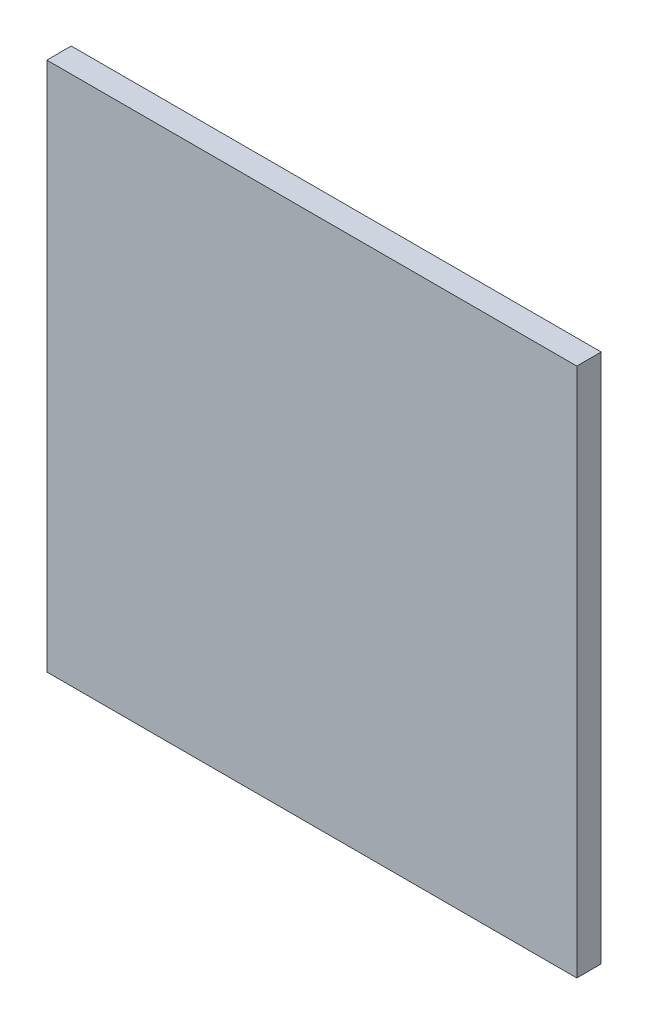
ISO-10303-21;
HEADER;
FILE_DESCRIPTION(('STEP AP214'),'2;1');
FILE_NAME('part.step','',(''),(''),'','','');
FILE_SCHEMA(('AUTOMOTIVE_DESIGN { 1 0 10303 214 1 1 1 1 }'));
ENDSEC;
DATA;
#1=APPLICATION_CONTEXT('core data for automotive mechanical design processes');
#2=APPLICATION_PROTOCOL_DEFINITION('international standard','automotive_design',2000,#1);
#3=PRODUCT_CONTEXT('',#1,'mechanical');
#4=PRODUCT('Part','Part','',(#3));
#5=PRODUCT_RELATED_PRODUCT_CATEGORY('part','',(#4));
#6=PRODUCT_DEFINITION_FORMATION('','',#4);
#7=PRODUCT_DEFINITION_CONTEXT('part definition',#1,'design');
#8=PRODUCT_DEFINITION('design','',#6,#7);
#9=PRODUCT_DEFINITION_SHAPE('','',#8);
#10=(LENGTH_UNIT() NAMED_UNIT(*) SI_UNIT(.MILLI.,.METRE.));
#11=(NAMED_UNIT(*) PLANE_ANGLE_UNIT() SI_UNIT($,.RADIAN.));
#12=(NAMED_UNIT(*) SI_UNIT($,.STERADIAN.) SOLID_ANGLE_UNIT());
#13=UNCERTAINTY_MEASURE_WITH_UNIT(LENGTH_MEASURE(1.E-05),#10,'distance_accuracy_value','');
#14=(GEOMETRIC_REPRESENTATION_CONTEXT(3) GLOBAL_UNCERTAINTY_ASSIGNED_CONTEXT((#13)) GLOBAL_UNIT_ASSIGNED_CONTEXT((#10,
#11,#12)) REPRESENTATION_CONTEXT('',''));
#15=CARTESIAN_POINT('',(0.,0.,0.));
#16=DIRECTION('',(0.,0.,1.));
#17=DIRECTION('',(1.,0.,0.));
#18=AXIS2_PLACEMENT_3D('',#15,#16,#17);
#19=CARTESIAN_POINT('',(177.49587155177,148.126483669053,2.3));
#20=DIRECTION('',(1.,0.,0.));
#21=DIRECTION('',(0.,1.,0.));
#22=AXIS2_PLACEMENT_3D('',#19,#20,#21);
#23=PLANE('',#22);
#24=DIRECTION('',(0.,-1.,0.));
#25=VECTOR('',#24,1.);
#26=CARTESIAN_POINT('',(177.49587155177,148.126483669053,0.));
#27=LINE('',#26,#25);
#28=CARTESIAN_POINT('',(177.49587155177,148.126483669053,0.));
#29=VERTEX_POINT('',#28);
#30=CARTESIAN_POINT('',(177.49587155177,98.1264836690532,0.));
#31=VERTEX_POINT('',#30);
#32=EDGE_CURVE('E100',#29,#31,#27,.T.);
#33=ORIENTED_EDGE('',*,*,#32,.T.);
#34=DIRECTION('',(0.,0.,-1.));
#35=VECTOR('',#34,1.);
#36=CARTESIAN_POINT('',(177.49587155177,98.1264836690532,2.3));
#37=LINE('',#36,#35);
#38=CARTESIAN_POINT('',(177.49587155177,98.1264836690532,2.3));
#39=VERTEX_POINT('',#38);
#40=EDGE_CURVE('E11',#39,#31,#37,.T.);
#41=ORIENTED_EDGE('',*,*,#40,.F.);
#42=DIRECTION('',(0.,-1.,0.));
#43=VECTOR('',#42,1.);
#44=CARTESIAN_POINT('',(177.49587155177,148.126483669053,2.3));
#45=LINE('',#44,#43);
#46=CARTESIAN_POINT('',(177.49587155177,148.126483669053,2.3));
#47=VERTEX_POINT('',#46);
#48=EDGE_CURVE('E88',#47,#39,#45,.T.);
#49=ORIENTED_EDGE('',*,*,#48,.F.);
#50=DIRECTION('',(0.,0.,-1.));
#51=VECTOR('',#50,1.);
#52=CARTESIAN_POINT('',(177.49587155177,148.126483669053,2.3));
#53=LINE('',#52,#51);
#54=EDGE_CURVE('E96',#47,#29,#53,.T.);
#55=ORIENTED_EDGE('',*,*,#54,.T.);
#56=EDGE_LOOP('',(#33,#41,#49,#55));
#57=FACE_BOUND('',#56,.T.);
#58=ADVANCED_FACE('F37',(#57),#23,.F.);
#59=CARTESIAN_POINT('',(177.49587155177,98.1264836690532,2.3));
#60=DIRECTION('',(0.,1.,0.));
#61=DIRECTION('',(0.,0.,1.));
#62=AXIS2_PLACEMENT_3D('',#59,#60,#61);
#63=PLANE('',#62);
#64=DIRECTION('',(1.,0.,0.));
#65=VECTOR('',#64,1.);
#66=CARTESIAN_POINT('',(177.49587155177,98.1264836690532,0.));
#67=LINE('',#66,#65);
#68=CARTESIAN_POINT('',(227.49587155177,98.1264836690532,0.));
#69=VERTEX_POINT('',#68);
#70=EDGE_CURVE('E92',#31,#69,#67,.T.);
#71=ORIENTED_EDGE('',*,*,#70,.T.);
#72=DIRECTION('',(0.,0.,-1.));
#73=VECTOR('',#72,1.);
#74=CARTESIAN_POINT('',(227.49587155177,98.1264836690532,2.3));
#75=LINE('',#74,#73);
#76=CARTESIAN_POINT('',(227.49587155177,98.1264836690532,2.3));
#77=VERTEX_POINT('',#76);
#78=EDGE_CURVE('E45',#77,#69,#75,.T.);
#79=ORIENTED_EDGE('',*,*,#78,.F.);
#80=DIRECTION('',(1.,0.,0.));
#81=VECTOR('',#80,1.);
#82=CARTESIAN_POINT('',(177.49587155177,98.1264836690532,2.3));
#83=LINE('',#82,#81);
#84=EDGE_CURVE('E83',#39,#77,#83,.T.);
#85=ORIENTED_EDGE('',*,*,#84,.F.);
#86=ORIENTED_EDGE('',*,*,#40,.T.);
#87=EDGE_LOOP('',(#71,#79,#85,#86));
#88=FACE_BOUND('',#87,.T.);
#89=ADVANCED_FACE('F91',(#88),#63,.F.);
#90=CARTESIAN_POINT('',(227.49587155177,148.126483669053,2.3));
#91=DIRECTION('',(-1.,0.,0.));
#92=DIRECTION('',(0.,-1.,0.));
#93=AXIS2_PLACEMENT_3D('',#90,#91,#92);
#94=PLANE('',#93);
#95=DIRECTION('',(0.,1.,0.));
#96=VECTOR('',#95,1.);
#97=CARTESIAN_POINT('',(227.49587155177,148.126483669053,0.));
#98=LINE('',#97,#96);
#99=CARTESIAN_POINT('',(227.49587155177,148.126483669053,0.));
#100=VERTEX_POINT('',#99);
#101=EDGE_CURVE('E70',#69,#100,#98,.T.);
#102=ORIENTED_EDGE('',*,*,#101,.T.);
#103=DIRECTION('',(0.,0.,-1.));
#104=VECTOR('',#103,1.);
#105=CARTESIAN_POINT('',(227.49587155177,148.126483669053,2.3));
#106=LINE('',#105,#104);
#107=CARTESIAN_POINT('',(227.49587155177,148.126483669053,2.3));
#108=VERTEX_POINT('',#107);
#109=EDGE_CURVE('E93',#108,#100,#106,.T.);
#110=ORIENTED_EDGE('',*,*,#109,.F.);
#111=DIRECTION('',(0.,1.,0.));
#112=VECTOR('',#111,1.);
#113=CARTESIAN_POINT('',(227.49587155177,148.126483669053,2.3));
#114=LINE('',#113,#112);
#115=EDGE_CURVE('E86',#77,#108,#114,.T.);
#116=ORIENTED_EDGE('',*,*,#115,.F.);
#117=ORIENTED_EDGE('',*,*,#78,.T.);
#118=EDGE_LOOP('',(#102,#110,#116,#117));
#119=FACE_BOUND('',#118,.T.);
#120=ADVANCED_FACE('F94',(#119),#94,.F.);
#121=CARTESIAN_POINT('',(177.49587155177,148.126483669053,2.3));
#122=DIRECTION('',(0.,-1.,0.));
#123=DIRECTION('',(0.,0.,-1.));
#124=AXIS2_PLACEMENT_3D('',#121,#122,#123);
#125=PLANE('',#124);
#126=DIRECTION('',(-1.,0.,0.));
#127=VECTOR('',#126,1.);
#128=CARTESIAN_POINT('',(177.49587155177,148.126483669053,0.));
#129=LINE('',#128,#127);
#130=EDGE_CURVE('E76',#100,#29,#129,.T.);
#131=ORIENTED_EDGE('',*,*,#130,.T.);
#132=ORIENTED_EDGE('',*,*,#54,.F.);
#133=DIRECTION('',(-1.,0.,0.));
#134=VECTOR('',#133,1.);
#135=CARTESIAN_POINT('',(177.49587155177,148.126483669053,2.3));
#136=LINE('',#135,#134);
#137=EDGE_CURVE('E53',#108,#47,#136,.T.);
#138=ORIENTED_EDGE('',*,*,#137,.F.);
#139=ORIENTED_EDGE('',*,*,#109,.T.);
#140=EDGE_LOOP('',(#131,#132,#138,#139));
#141=FACE_BOUND('',#140,.T.);
#142=ADVANCED_FACE('F107',(#141),#125,.F.);
#143=CARTESIAN_POINT('',(0.,0.,2.3));
#144=DIRECTION('',(0.,0.,1.));
#145=DIRECTION('',(1.,0.,0.));
#146=AXIS2_PLACEMENT_3D('',#143,#144,#145);
#147=PLANE('',#146);
#148=ORIENTED_EDGE('',*,*,#48,.T.);
#149=ORIENTED_EDGE('',*,*,#84,.T.);
#150=ORIENTED_EDGE('',*,*,#115,.T.);
#151=ORIENTED_EDGE('',*,*,#137,.T.);
#152=EDGE_LOOP('',(#148,#149,#150,#151));
#153=FACE_BOUND('',#152,.T.);
#154=ADVANCED_FACE('F84',(#153),#147,.T.);
#155=CARTESIAN_POINT('',(0.,0.,0.));
#156=DIRECTION('',(0.,0.,1.));
#157=DIRECTION('',(1.,0.,0.));
#158=AXIS2_PLACEMENT_3D('',#155,#156,#157);
#159=PLANE('',#158);
#160=ORIENTED_EDGE('',*,*,#32,.F.);
#161=ORIENTED_EDGE('',*,*,#130,.F.);
#162=ORIENTED_EDGE('',*,*,#101,.F.);
#163=ORIENTED_EDGE('',*,*,#70,.F.);
#164=EDGE_LOOP('',(#160,#161,#162,#163));
#165=FACE_BOUND('',#164,.T.);
#166=ADVANCED_FACE('F110',(#165),#159,.F.);
#167=CLOSED_SHELL('',(#58,#89,#120,#142,#154,#166));
#168=MANIFOLD_SOLID_BREP('B2',#167);
#169=ADVANCED_BREP_SHAPE_REPRESENTATION('',(#18,#168),#14);
#170=SHAPE_DEFINITION_REPRESENTATION(#9,#169);
ENDSEC;
END-ISO-10303-21;
